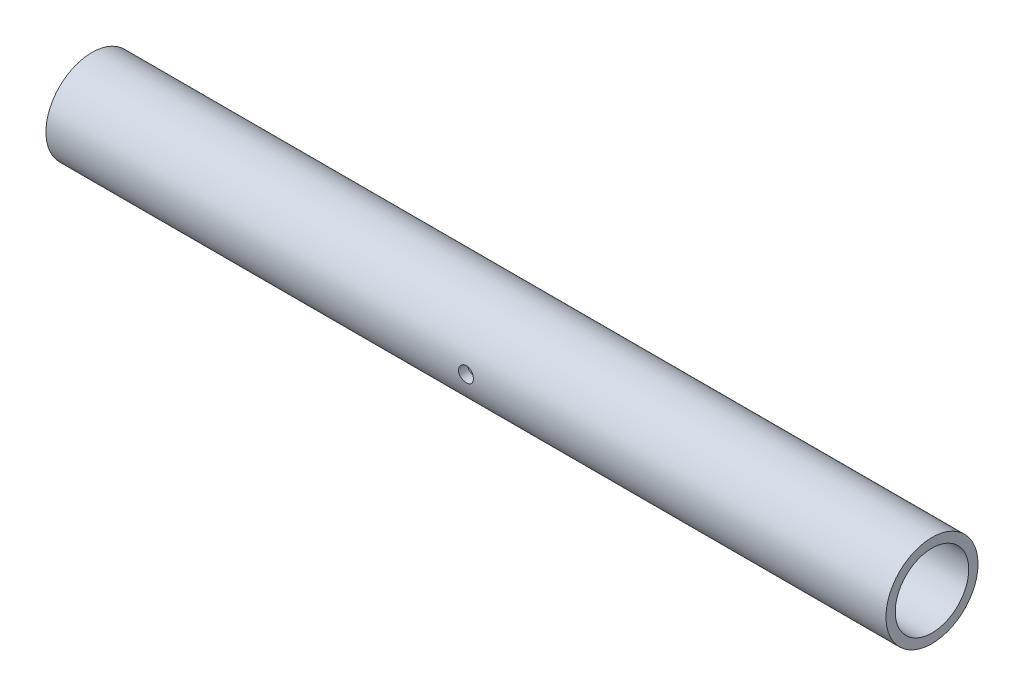
ISO-10303-21;
HEADER;
FILE_DESCRIPTION(('STEP AP214'),'2;1');
FILE_NAME('part.step','',(''),(''),'','','');
FILE_SCHEMA(('AUTOMOTIVE_DESIGN { 1 0 10303 214 1 1 1 1 }'));
ENDSEC;
DATA;
#1=APPLICATION_CONTEXT('core data for automotive mechanical design processes');
#2=APPLICATION_PROTOCOL_DEFINITION('international standard','automotive_design',2000,#1);
#3=PRODUCT_CONTEXT('',#1,'mechanical');
#4=PRODUCT('Part','Part','',(#3));
#5=PRODUCT_RELATED_PRODUCT_CATEGORY('part','',(#4));
#6=PRODUCT_DEFINITION_FORMATION('','',#4);
#7=PRODUCT_DEFINITION_CONTEXT('part definition',#1,'design');
#8=PRODUCT_DEFINITION('design','',#6,#7);
#9=PRODUCT_DEFINITION_SHAPE('','',#8);
#10=(LENGTH_UNIT() NAMED_UNIT(*) SI_UNIT(.MILLI.,.METRE.));
#11=(NAMED_UNIT(*) PLANE_ANGLE_UNIT() SI_UNIT($,.RADIAN.));
#12=(NAMED_UNIT(*) SI_UNIT($,.STERADIAN.) SOLID_ANGLE_UNIT());
#13=UNCERTAINTY_MEASURE_WITH_UNIT(LENGTH_MEASURE(1.E-05),#10,'distance_accuracy_value','');
#14=(GEOMETRIC_REPRESENTATION_CONTEXT(3) GLOBAL_UNCERTAINTY_ASSIGNED_CONTEXT((#13)) GLOBAL_UNIT_ASSIGNED_CONTEXT((#10,
#11,#12)) REPRESENTATION_CONTEXT('',''));
#15=CARTESIAN_POINT('',(0.,0.,0.));
#16=DIRECTION('',(0.,0.,1.));
#17=DIRECTION('',(1.,0.,0.));
#18=AXIS2_PLACEMENT_3D('',#15,#16,#17);
#19=CARTESIAN_POINT('',(304.8,0.,0.));
#20=DIRECTION('',(1.,0.,0.));
#21=DIRECTION('',(0.,0.,-1.));
#22=AXIS2_PLACEMENT_3D('',#19,#20,#21);
#23=PLANE('',#22);
#24=CARTESIAN_POINT('',(304.8,0.,0.));
#25=DIRECTION('',(1.,0.,0.));
#26=DIRECTION('',(0.,0.,-1.));
#27=AXIS2_PLACEMENT_3D('',#24,#25,#26);
#28=CIRCLE('',#27,16.7005);
#29=CARTESIAN_POINT('',(304.8,0.,-16.7005));
#30=VERTEX_POINT('',#29);
#31=EDGE_CURVE('E10',#30,#30,#28,.T.);
#32=ORIENTED_EDGE('',*,*,#31,.T.);
#33=EDGE_LOOP('',(#32));
#34=FACE_BOUND('',#33,.T.);
#35=CARTESIAN_POINT('',(304.8,0.,0.));
#36=DIRECTION('',(1.,0.,0.));
#37=DIRECTION('',(0.,0.,-1.));
#38=AXIS2_PLACEMENT_3D('',#35,#36,#37);
#39=CIRCLE('',#38,13.335);
#40=CARTESIAN_POINT('',(304.8,0.,-13.335));
#41=VERTEX_POINT('',#40);
#42=EDGE_CURVE('E46',#41,#41,#39,.T.);
#43=ORIENTED_EDGE('',*,*,#42,.F.);
#44=EDGE_LOOP('',(#43));
#45=FACE_BOUND('',#44,.T.);
#46=ADVANCED_FACE('F34',(#34,#45),#23,.T.);
#47=CARTESIAN_POINT('',(0.,0.,0.));
#48=DIRECTION('',(1.,0.,0.));
#49=DIRECTION('',(0.,0.,-1.));
#50=AXIS2_PLACEMENT_3D('',#47,#48,#49);
#51=PLANE('',#50);
#52=CARTESIAN_POINT('',(0.,0.,0.));
#53=DIRECTION('',(1.,0.,0.));
#54=DIRECTION('',(0.,0.,-1.));
#55=AXIS2_PLACEMENT_3D('',#52,#53,#54);
#56=CIRCLE('',#55,16.7005);
#57=CARTESIAN_POINT('',(0.,0.,-16.7005));
#58=VERTEX_POINT('',#57);
#59=EDGE_CURVE('E39',#58,#58,#56,.T.);
#60=ORIENTED_EDGE('',*,*,#59,.F.);
#61=EDGE_LOOP('',(#60));
#62=FACE_BOUND('',#61,.T.);
#63=CARTESIAN_POINT('',(0.,0.,0.));
#64=DIRECTION('',(1.,0.,0.));
#65=DIRECTION('',(0.,0.,-1.));
#66=AXIS2_PLACEMENT_3D('',#63,#64,#65);
#67=CIRCLE('',#66,13.335);
#68=CARTESIAN_POINT('',(0.,0.,-13.335));
#69=VERTEX_POINT('',#68);
#70=EDGE_CURVE('E48',#69,#69,#67,.T.);
#71=ORIENTED_EDGE('',*,*,#70,.T.);
#72=EDGE_LOOP('',(#71));
#73=FACE_BOUND('',#72,.T.);
#74=ADVANCED_FACE('F77',(#62,#73),#51,.F.);
#75=CARTESIAN_POINT('',(304.8,0.,0.));
#76=DIRECTION('',(-1.,0.,0.));
#77=DIRECTION('',(0.,0.,1.));
#78=AXIS2_PLACEMENT_3D('',#75,#76,#77);
#79=CYLINDRICAL_SURFACE('',#78,16.7005);
#80=CARTESIAN_POINT('',(155.1051,0.,16.7005));
#81=CARTESIAN_POINT('',(155.105093897087,-0.150888062548303,16.7004974577365));
#82=CARTESIAN_POINT('',(155.092432758379,-0.301859994666066,16.6984337641219));
#83=CARTESIAN_POINT('',(155.042141383676,-0.599573765303217,16.6903999723937));
#84=CARTESIAN_POINT('',(155.004487792628,-0.746311513080885,16.6844262204648));
#85=CARTESIAN_POINT('',(154.90537472287,-1.0312061766267,16.6692427211351));
#86=CARTESIAN_POINT('',(154.843934287842,-1.16936985436145,16.6600355629369));
#87=CARTESIAN_POINT('',(154.699040513581,-1.43340829062403,16.6393990707399));
#88=CARTESIAN_POINT('',(154.615589848481,-1.55928453946972,16.6279700067358));
#89=CARTESIAN_POINT('',(154.428240590823,-1.79633294529008,16.6040421740029));
#90=CARTESIAN_POINT('',(154.324181856033,-1.90737774983379,16.591535491026));
#91=CARTESIAN_POINT('',(154.098914989324,-2.1105114085896,16.5669229733114));
#92=CARTESIAN_POINT('',(153.977705804489,-2.20259909811607,16.5548171632407));
#93=CARTESIAN_POINT('',(153.720709403468,-2.36571066174806,16.5323003820462));
#94=CARTESIAN_POINT('',(153.58484178218,-2.43660938550688,16.521899638475));
#95=CARTESIAN_POINT('',(153.302929431016,-2.55453030416696,16.5040799174436));
#96=CARTESIAN_POINT('',(153.156885350204,-2.60155402025599,16.4966607500196));
#97=CARTESIAN_POINT('',(152.860112716242,-2.66999048982907,16.4857227198729));
#98=CARTESIAN_POINT('',(152.709435998324,-2.69162258951269,16.4821704723586));
#99=CARTESIAN_POINT('',(152.406552768084,-2.70934168919743,16.4792673895096));
#100=CARTESIAN_POINT('',(152.254346358719,-2.70543039707,16.4799162732805));
#101=CARTESIAN_POINT('',(151.954285356396,-2.67235257585698,16.4853116422221));
#102=CARTESIAN_POINT('',(151.806402847489,-2.64343183378623,16.4900182476923));
#103=CARTESIAN_POINT('',(151.517617291042,-2.56154150799834,16.502936357017));
#104=CARTESIAN_POINT('',(151.37671447089,-2.50857114134623,16.5111479749766));
#105=CARTESIAN_POINT('',(151.105148697648,-2.37983413536215,16.5301942305314));
#106=CARTESIAN_POINT('',(150.974535269656,-2.30396483733819,16.5410406365502));
#107=CARTESIAN_POINT('',(150.727800002518,-2.13165657059765,16.5641260861383));
#108=CARTESIAN_POINT('',(150.611679270523,-2.03521603188844,16.5763652359683));
#109=CARTESIAN_POINT('',(150.395802387933,-1.82316079178855,16.6010326457947));
#110=CARTESIAN_POINT('',(150.296253457762,-1.70733507940944,16.6134614436807));
#111=CARTESIAN_POINT('',(150.117973519348,-1.46051261763989,16.6369752748997));
#112=CARTESIAN_POINT('',(150.039242631801,-1.32951578029888,16.6480603004418));
#113=CARTESIAN_POINT('',(149.904817203808,-1.05587919110396,16.6676520858549));
#114=CARTESIAN_POINT('',(149.849140292661,-0.913230628642439,16.6761568713015));
#115=CARTESIAN_POINT('',(149.762592033457,-0.620439017931161,16.689613888894));
#116=CARTESIAN_POINT('',(149.731718726758,-0.470296562439258,16.6945664015455));
#117=CARTESIAN_POINT('',(149.695933402982,-0.16856590589134,16.7003233068798));
#118=CARTESIAN_POINT('',(149.690736794805,-0.0170122941565777,16.7011731693918));
#119=CARTESIAN_POINT('',(149.705694623299,0.284800682339517,16.6987533332108));
#120=CARTESIAN_POINT('',(149.725848140432,0.435060093846976,16.6954837839433));
#121=CARTESIAN_POINT('',(149.79069743882,0.729145269491143,16.6852206333956));
#122=CARTESIAN_POINT('',(149.835252978216,0.873002765566383,16.6782483193063));
#123=CARTESIAN_POINT('',(149.947492520573,1.15120604540566,16.6613584524574));
#124=CARTESIAN_POINT('',(150.015177761857,1.28555131943812,16.6514407420105));
#125=CARTESIAN_POINT('',(150.172411794106,1.54215720864201,16.629647987126));
#126=CARTESIAN_POINT('',(150.262139161391,1.66430704194941,16.6177572269374));
#127=CARTESIAN_POINT('',(150.460663902427,1.89191696449165,16.5933865628871));
#128=CARTESIAN_POINT('',(150.569462579924,1.99737591177163,16.5809066187905));
#129=CARTESIAN_POINT('',(150.804315231753,2.18965975513515,16.5566179523259));
#130=CARTESIAN_POINT('',(150.93052720777,2.27629280016818,16.5448169671038));
#131=CARTESIAN_POINT('',(151.195879626388,2.42712761732702,16.5233646792845));
#132=CARTESIAN_POINT('',(151.335019675855,2.49133007126879,16.5137133113492));
#133=CARTESIAN_POINT('',(151.62173175804,2.59519124980596,16.4977104952734));
#134=CARTESIAN_POINT('',(151.769267861794,2.6349470586088,16.4913460103877));
#135=CARTESIAN_POINT('',(152.069034939324,2.68909299931143,16.4826042915982));
#136=CARTESIAN_POINT('',(152.221265528669,2.70348520265564,16.4802267320832));
#137=CARTESIAN_POINT('',(152.524185617428,2.70644008511556,16.4797415544371));
#138=CARTESIAN_POINT('',(152.674872177798,2.69530464320214,16.4815840317318));
#139=CARTESIAN_POINT('',(152.972198053532,2.64817138492831,16.4892222214147));
#140=CARTESIAN_POINT('',(153.118837379963,2.61217363655834,16.4950179229922));
#141=CARTESIAN_POINT('',(153.403799112764,2.51645069874717,16.5098910068696));
#142=CARTESIAN_POINT('',(153.542129961818,2.45675008128221,16.5189649898099));
#143=CARTESIAN_POINT('',(153.806861126234,2.31534678208125,16.5393757512933));
#144=CARTESIAN_POINT('',(153.933260903651,2.23364310891717,16.5507126317935));
#145=CARTESIAN_POINT('',(154.172069631771,2.0494698849786,16.5745306822589));
#146=CARTESIAN_POINT('',(154.284305840065,1.94677779193518,16.5870232561983));
#147=CARTESIAN_POINT('',(154.490057277457,1.72401256578686,16.6116529092408));
#148=CARTESIAN_POINT('',(154.583568172536,1.60393541992531,16.6237899054911));
#149=CARTESIAN_POINT('',(154.749765732965,1.34888505958874,16.6464318057398));
#150=CARTESIAN_POINT('',(154.822313353884,1.21382025362174,16.6569256097812));
#151=CARTESIAN_POINT('',(154.943580335504,0.933308987477759,16.6749905845962));
#152=CARTESIAN_POINT('',(154.992323705429,0.787873158058099,16.6825646985689));
#153=CARTESIAN_POINT('',(155.053878589069,0.534871671086589,16.6922617563775));
#154=CARTESIAN_POINT('',(155.073056270392,0.428846028496355,16.6953347747841));
#155=CARTESIAN_POINT('',(155.098669052378,0.215227800139453,16.6994547874161));
#156=CARTESIAN_POINT('',(155.105104353482,0.107635239047601,16.7005018135109));
#157=CARTESIAN_POINT('',(155.1051,0.,16.7005));
#158=B_SPLINE_CURVE_WITH_KNOTS('',3,(#80,#81,#82,#83,#84,#85,#86,#87,#88,#89,#90,#91,#92,#93,
#94,#95,#96,#97,#98,#99,#100,#101,#102,#103,#104,#105,#106,#107,#108,#109,#110,#111,#112,#113,
#114,#115,#116,#117,#118,#119,#120,#121,#122,#123,#124,#125,#126,#127,#128,#129,#130,#131,#132,
#133,#134,#135,#136,#137,#138,#139,#140,#141,#142,#143,#144,#145,#146,#147,#148,#149,#150,#151,
#152,#153,#154,#155,#156,#157),.UNSPECIFIED.,.T.,.F.,(4,2,2,2,2,2,2,2,2,2,2,2,2,2,2,2,2,2,2,2,2,
2,2,2,2,2,2,2,2,2,2,2,2,2,2,2,2,2,4),(0.,0.452270787216408,0.904964810512096,1.35729715518357,
1.80957456901735,2.26551517452944,2.72148378372722,3.18009458772586,3.63867616782943,
4.09326642255645,4.54782628297365,4.9979689596137,5.44812629168908,5.90033249063431,
6.35257321421474,6.81010181368963,7.26763306569815,7.7255135470429,8.18335786781695,
8.63611604666351,9.08885780285638,9.53902448404456,9.98921527009213,10.4431811075173,
10.8971779909038,11.3556045004122,11.8140170740548,12.2705972081985,12.7271400517363,
13.1783119065942,13.6294825276468,14.0801866512621,14.5309110863978,14.9866887137601,
15.4425717103213,15.9014124875041,16.3597895122137,16.6824196742317,17.0050447611613),.UNSPECIFIED.);
#159=CARTESIAN_POINT('',(155.1051,0.,16.7005));
#160=VERTEX_POINT('',#159);
#161=EDGE_CURVE('E51',#160,#160,#158,.T.);
#162=ORIENTED_EDGE('',*,*,#161,.T.);
#163=EDGE_LOOP('',(#162));
#164=FACE_BOUND('',#163,.T.);
#165=ORIENTED_EDGE('',*,*,#31,.F.);
#166=EDGE_LOOP('',(#165));
#167=FACE_BOUND('',#166,.T.);
#168=ORIENTED_EDGE('',*,*,#59,.T.);
#169=EDGE_LOOP('',(#168));
#170=FACE_BOUND('',#169,.T.);
#171=ADVANCED_FACE('F36',(#164,#167,#170),#79,.T.);
#172=CARTESIAN_POINT('',(304.8,0.,0.));
#173=DIRECTION('',(-1.,0.,0.));
#174=DIRECTION('',(0.,0.,1.));
#175=AXIS2_PLACEMENT_3D('',#172,#173,#174);
#176=CYLINDRICAL_SURFACE('',#175,13.335);
#177=CARTESIAN_POINT('',(155.1051,0.,13.335));
#178=CARTESIAN_POINT('',(155.105094525376,-0.150295600484553,13.3349972242289));
#179=CARTESIAN_POINT('',(155.092532026992,-0.300659946654723,13.3324330403292));
#180=CARTESIAN_POINT('',(155.0426556573,-0.597135385188636,13.3224513830455));
#181=CARTESIAN_POINT('',(155.00532241314,-0.743243055026255,13.3150301110628));
#182=CARTESIAN_POINT('',(154.907107787482,-1.02687601225216,13.296162618508));
#183=CARTESIAN_POINT('',(154.84624926408,-1.16440948049959,13.2847203059164));
#184=CARTESIAN_POINT('',(154.702780252209,-1.4273047577558,13.2590533011895));
#185=CARTESIAN_POINT('',(154.620170950095,-1.55266723009767,13.2448287608163));
#186=CARTESIAN_POINT('',(154.434327195231,-1.7894149071107,13.2149405065597));
#187=CARTESIAN_POINT('',(154.330848481905,-1.9006064034824,13.199261063324));
#188=CARTESIAN_POINT('',(154.106728265231,-2.10417816613857,13.168344071895));
#189=CARTESIAN_POINT('',(153.986085396097,-2.19655693403454,13.1531065589832));
#190=CARTESIAN_POINT('',(153.729662382321,-2.36070988620932,13.1246448707219));
#191=CARTESIAN_POINT('',(153.593750860226,-2.43228266379821,13.1114409219455));
#192=CARTESIAN_POINT('',(153.311518766293,-2.55150142471515,13.0887651113974));
#193=CARTESIAN_POINT('',(153.165199255873,-2.59914984389556,13.0792928697041));
#194=CARTESIAN_POINT('',(152.868391357684,-2.6685367944566,13.0653122596412));
#195=CARTESIAN_POINT('',(152.717985662028,-2.69061565322798,13.0607387529412));
#196=CARTESIAN_POINT('',(152.415540625344,-2.70929399940926,13.0568774442569));
#197=CARTESIAN_POINT('',(152.263501457958,-2.70589616880503,13.0575890858936));
#198=CARTESIAN_POINT('',(151.964601070229,-2.67399255726,13.0641585153922));
#199=CARTESIAN_POINT('',(151.817696102583,-2.64587767366682,13.0699361809375));
#200=CARTESIAN_POINT('',(151.530732268451,-2.56595538643003,13.0858604269536));
#201=CARTESIAN_POINT('',(151.390673737762,-2.51414682197339,13.0960072214775));
#202=CARTESIAN_POINT('',(151.120256078371,-2.38793669722346,13.1196079166759));
#203=CARTESIAN_POINT('',(150.989970984035,-2.31338088418128,13.1330842731062));
#204=CARTESIAN_POINT('',(150.74361439873,-2.14390140848478,13.1618113260375));
#205=CARTESIAN_POINT('',(150.627544588842,-2.04897534051733,13.1770622319794));
#206=CARTESIAN_POINT('',(150.410658529072,-1.83936052489874,13.207966610656));
#207=CARTESIAN_POINT('',(150.310164588826,-1.72433832876226,13.2236223079897));
#208=CARTESIAN_POINT('',(150.129845547073,-1.47890259644831,13.2533138361505));
#209=CARTESIAN_POINT('',(150.050020725472,-1.34848885186894,13.2673496450393));
#210=CARTESIAN_POINT('',(149.913243309945,-1.07560877370192,13.2922559746792));
#211=CARTESIAN_POINT('',(149.856328351573,-0.9331230696536,13.3031212790442));
#212=CARTESIAN_POINT('',(149.767334173484,-0.640342655170266,13.3204229182029));
#213=CARTESIAN_POINT('',(149.735251857011,-0.490048920930976,13.3268598052313));
#214=CARTESIAN_POINT('',(149.697291809661,-0.188687712334038,13.3345021896925));
#215=CARTESIAN_POINT('',(149.69097311446,-0.037677946869132,13.3357957101814));
#216=CARTESIAN_POINT('',(149.703530978531,0.263239556156422,13.3332504287549));
#217=CARTESIAN_POINT('',(149.722406078805,0.413147357027401,13.32941192404));
#218=CARTESIAN_POINT('',(149.784449478553,0.706177355722136,13.3170890419464));
#219=CARTESIAN_POINT('',(149.827390777664,0.849349603396196,13.3086480961947));
#220=CARTESIAN_POINT('',(149.936098999973,1.12646132397948,13.2880635649464));
#221=CARTESIAN_POINT('',(150.001867669613,1.26040008952707,13.2759196961607));
#222=CARTESIAN_POINT('',(150.1553124641,1.51709720534946,13.249057435921));
#223=CARTESIAN_POINT('',(150.243253128819,1.63969417441024,13.234308651375));
#224=CARTESIAN_POINT('',(150.438192261469,1.86854925612131,13.2039425775509));
#225=CARTESIAN_POINT('',(150.545192835727,1.97480556053181,13.1883251924146));
#226=CARTESIAN_POINT('',(150.777224325758,2.16967113581846,13.1576842969314));
#227=CARTESIAN_POINT('',(150.902511858808,2.2579772780275,13.1426739537023));
#228=CARTESIAN_POINT('',(151.166400440108,2.41229295069217,13.1152291615274));
#229=CARTESIAN_POINT('',(151.305000947602,2.47830338628301,13.1027946080206));
#230=CARTESIAN_POINT('',(151.590874470357,2.58574384042946,13.0820163622959));
#231=CARTESIAN_POINT('',(151.738097250659,2.62730316903986,13.0736511905723));
#232=CARTESIAN_POINT('',(152.037624714809,2.68505210426675,13.0619142618958));
#233=CARTESIAN_POINT('',(152.189928711529,2.70124512705367,13.058541832556));
#234=CARTESIAN_POINT('',(152.492249983923,2.70767252503984,13.0572103103202));
#235=CARTESIAN_POINT('',(152.642256835453,2.69838611838186,13.0591512812084));
#236=CARTESIAN_POINT('',(152.938522306478,2.65517792546284,13.0680041721845));
#237=CARTESIAN_POINT('',(153.084780958013,2.62125634986901,13.0749160497637));
#238=CARTESIAN_POINT('',(153.369082210092,2.52995717578002,13.0928866727968));
#239=CARTESIAN_POINT('',(153.507144922099,2.47263996377305,13.1039347363055));
#240=CARTESIAN_POINT('',(153.771768617197,2.33623222267459,13.1289386922158));
#241=CARTESIAN_POINT('',(153.898328599311,2.25713980109381,13.1428948373339));
#242=CARTESIAN_POINT('',(154.138737028366,2.07779697949024,13.1724471666242));
#243=CARTESIAN_POINT('',(154.252324843556,1.97720115843756,13.188067738479));
#244=CARTESIAN_POINT('',(154.461166037052,1.75841835754841,13.2190155313656));
#245=CARTESIAN_POINT('',(154.556415194048,1.64022733861366,13.2343426841269));
#246=CARTESIAN_POINT('',(154.726850865077,1.38807123157175,13.2631724688158));
#247=CARTESIAN_POINT('',(154.801809092012,1.25394927014427,13.276653559364));
#248=CARTESIAN_POINT('',(154.928003538366,0.974774923026418,13.3000597177516));
#249=CARTESIAN_POINT('',(154.97926092306,0.829732424717033,13.3099879565525));
#250=CARTESIAN_POINT('',(155.046787117943,0.570324604330927,13.3232639467522));
#251=CARTESIAN_POINT('',(155.068615067119,0.45742586083621,13.327638992893));
#252=CARTESIAN_POINT('',(155.097773357139,0.22969808726299,13.3335080319502));
#253=CARTESIAN_POINT('',(155.10510418419,0.114869122050805,13.3350021214885));
#254=CARTESIAN_POINT('',(155.1051,0.,13.335));
#255=B_SPLINE_CURVE_WITH_KNOTS('',3,(#177,#178,#179,#180,#181,#182,#183,#184,#185,#186,#187,
#188,#189,#190,#191,#192,#193,#194,#195,#196,#197,#198,#199,#200,#201,#202,#203,#204,#205,#206,
#207,#208,#209,#210,#211,#212,#213,#214,#215,#216,#217,#218,#219,#220,#221,#222,#223,#224,#225,
#226,#227,#228,#229,#230,#231,#232,#233,#234,#235,#236,#237,#238,#239,#240,#241,#242,#243,#244,
#245,#246,#247,#248,#249,#250,#251,#252,#253,#254),.UNSPECIFIED.,.T.,.F.,(4,2,2,2,2,2,2,2,2,2,2,
2,2,2,2,2,2,2,2,2,2,2,2,2,2,2,2,2,2,2,2,2,2,2,2,2,2,2,4),(0.,0.450466540959125,
0.901285801401294,1.35166812455106,1.80202588755751,2.25799744724725,2.71400530978153,
3.17429068540293,3.63452918768033,4.0885689020244,4.54256081930287,4.98949951624589,
5.43646011218639,5.88652164703375,6.33663635427288,6.79508725203935,7.25354435795345,
7.71275155793441,8.1719014832478,8.62315884642445,9.07439007798768,9.52143509257741,
9.96851431656822,10.4212035028349,10.8739427471937,11.3337873895974,11.7936133615181,
12.2509851539842,12.7082953452709,13.1570636849492,13.6058281870383,14.0534416345438,
14.501093996541,14.9565651472641,15.4121410161987,15.8726474155708,16.3327417764777,
16.677039489884,17.0213256559887),.UNSPECIFIED.);
#256=CARTESIAN_POINT('',(155.1051,0.,13.335));
#257=VERTEX_POINT('',#256);
#258=EDGE_CURVE('E60',#257,#257,#255,.T.);
#259=ORIENTED_EDGE('',*,*,#258,.F.);
#260=EDGE_LOOP('',(#259));
#261=FACE_BOUND('',#260,.T.);
#262=ORIENTED_EDGE('',*,*,#42,.T.);
#263=EDGE_LOOP('',(#262));
#264=FACE_BOUND('',#263,.T.);
#265=ORIENTED_EDGE('',*,*,#70,.F.);
#266=EDGE_LOOP('',(#265));
#267=FACE_BOUND('',#266,.T.);
#268=ADVANCED_FACE('F68',(#261,#264,#267),#176,.F.);
#269=CARTESIAN_POINT('',(152.4,0.,16.7005));
#270=DIRECTION('',(0.,0.,1.));
#271=DIRECTION('',(1.,0.,0.));
#272=AXIS2_PLACEMENT_3D('',#269,#270,#271);
#273=CYLINDRICAL_SURFACE('',#272,2.70509999999999);
#274=ORIENTED_EDGE('',*,*,#258,.T.);
#275=EDGE_LOOP('',(#274));
#276=FACE_BOUND('',#275,.T.);
#277=ORIENTED_EDGE('',*,*,#161,.F.);
#278=EDGE_LOOP('',(#277));
#279=FACE_BOUND('',#278,.T.);
#280=ADVANCED_FACE('F65',(#276,#279),#273,.F.);
#281=CLOSED_SHELL('',(#46,#74,#171,#268,#280));
#282=MANIFOLD_SOLID_BREP('B2',#281);
#283=ADVANCED_BREP_SHAPE_REPRESENTATION('',(#18,#282),#14);
#284=SHAPE_DEFINITION_REPRESENTATION(#9,#283);
ENDSEC;
END-ISO-10303-21;
